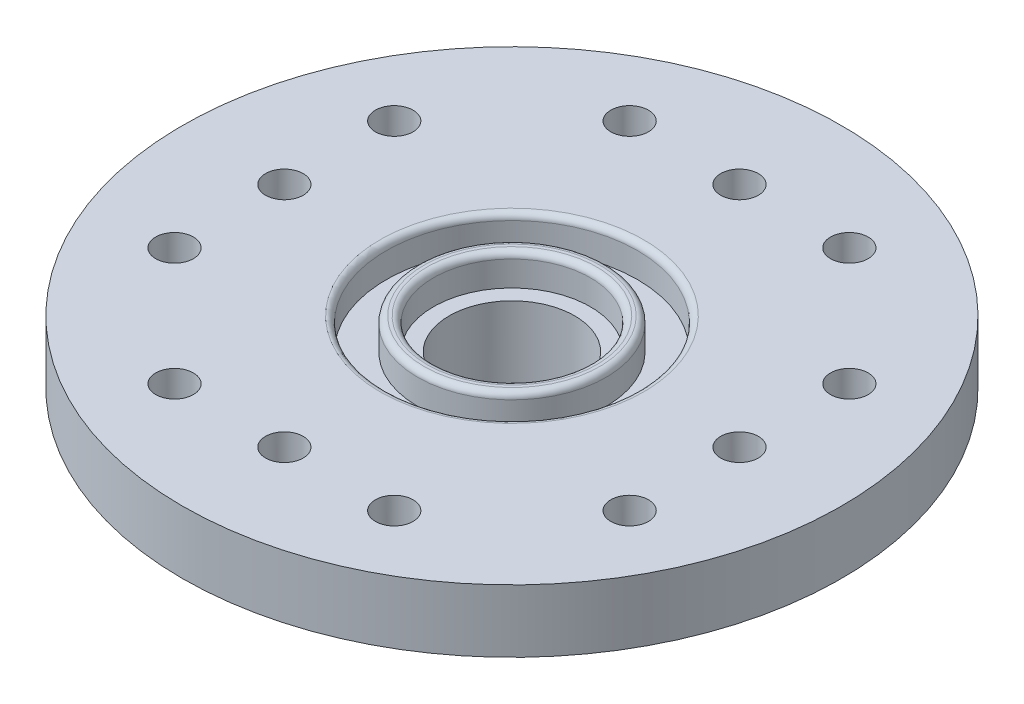
ISO-10303-21;
HEADER;
FILE_DESCRIPTION(('STEP AP214'),'2;1');
FILE_NAME('part.step','',(''),(''),'','','');
FILE_SCHEMA(('AUTOMOTIVE_DESIGN { 1 0 10303 214 1 1 1 1 }'));
ENDSEC;
DATA;
#1=APPLICATION_CONTEXT('core data for automotive mechanical design processes');
#2=APPLICATION_PROTOCOL_DEFINITION('international standard','automotive_design',2000,#1);
#3=PRODUCT_CONTEXT('',#1,'mechanical');
#4=PRODUCT('Part','Part','',(#3));
#5=PRODUCT_RELATED_PRODUCT_CATEGORY('part','',(#4));
#6=PRODUCT_DEFINITION_FORMATION('','',#4);
#7=PRODUCT_DEFINITION_CONTEXT('part definition',#1,'design');
#8=PRODUCT_DEFINITION('design','',#6,#7);
#9=PRODUCT_DEFINITION_SHAPE('','',#8);
#10=(LENGTH_UNIT() NAMED_UNIT(*) SI_UNIT(.MILLI.,.METRE.));
#11=(NAMED_UNIT(*) PLANE_ANGLE_UNIT() SI_UNIT($,.RADIAN.));
#12=(NAMED_UNIT(*) SI_UNIT($,.STERADIAN.) SOLID_ANGLE_UNIT());
#13=UNCERTAINTY_MEASURE_WITH_UNIT(LENGTH_MEASURE(1.E-05),#10,'distance_accuracy_value','');
#14=(GEOMETRIC_REPRESENTATION_CONTEXT(3) GLOBAL_UNCERTAINTY_ASSIGNED_CONTEXT((#13)) GLOBAL_UNIT_ASSIGNED_CONTEXT((#10,
#11,#12)) REPRESENTATION_CONTEXT('',''));
#15=CARTESIAN_POINT('',(0.,0.,0.));
#16=DIRECTION('',(0.,0.,1.));
#17=DIRECTION('',(1.,0.,0.));
#18=AXIS2_PLACEMENT_3D('',#15,#16,#17);
#19=CARTESIAN_POINT('',(0.,-3.,0.));
#20=DIRECTION('',(0.,1.,0.));
#21=DIRECTION('',(0.,0.,1.));
#22=AXIS2_PLACEMENT_3D('',#19,#20,#21);
#23=CYLINDRICAL_SURFACE('',#22,2.);
#24=CARTESIAN_POINT('',(0.,-3.,0.));
#25=DIRECTION('',(0.,-1.,0.));
#26=DIRECTION('',(0.,0.,-1.));
#27=AXIS2_PLACEMENT_3D('',#24,#25,#26);
#28=CIRCLE('',#27,2.);
#29=CARTESIAN_POINT('',(0.,-3.,-2.));
#30=VERTEX_POINT('',#29);
#31=EDGE_CURVE('E124',#30,#30,#28,.T.);
#32=ORIENTED_EDGE('',*,*,#31,.T.);
#33=EDGE_LOOP('',(#32));
#34=FACE_BOUND('',#33,.T.);
#35=CARTESIAN_POINT('',(0.,1.,0.));
#36=DIRECTION('',(0.,1.,0.));
#37=DIRECTION('',(0.,0.,1.));
#38=AXIS2_PLACEMENT_3D('',#35,#36,#37);
#39=CIRCLE('',#38,2.);
#40=CARTESIAN_POINT('',(0.,1.,2.));
#41=VERTEX_POINT('',#40);
#42=EDGE_CURVE('E108',#41,#41,#39,.T.);
#43=ORIENTED_EDGE('',*,*,#42,.T.);
#44=EDGE_LOOP('',(#43));
#45=FACE_BOUND('',#44,.T.);
#46=ADVANCED_FACE('F32',(#34,#45),#23,.F.);
#47=CARTESIAN_POINT('',(0.,2.,0.));
#48=DIRECTION('',(0.,-1.,0.));
#49=DIRECTION('',(0.,0.,-1.));
#50=AXIS2_PLACEMENT_3D('',#47,#48,#49);
#51=CYLINDRICAL_SURFACE('',#50,10.5);
#52=CARTESIAN_POINT('',(0.,2.,0.));
#53=DIRECTION('',(0.,1.,0.));
#54=DIRECTION('',(0.,0.,1.));
#55=AXIS2_PLACEMENT_3D('',#52,#53,#54);
#56=CIRCLE('',#55,10.5);
#57=CARTESIAN_POINT('',(0.,2.,10.5));
#58=VERTEX_POINT('',#57);
#59=EDGE_CURVE('E120',#58,#58,#56,.T.);
#60=ORIENTED_EDGE('',*,*,#59,.F.);
#61=EDGE_LOOP('',(#60));
#62=FACE_BOUND('',#61,.T.);
#63=CARTESIAN_POINT('',(0.,0.,0.));
#64=DIRECTION('',(0.,1.,0.));
#65=DIRECTION('',(0.,0.,1.));
#66=AXIS2_PLACEMENT_3D('',#63,#64,#65);
#67=CIRCLE('',#66,10.5);
#68=CARTESIAN_POINT('',(0.,0.,10.5));
#69=VERTEX_POINT('',#68);
#70=EDGE_CURVE('E121',#69,#69,#67,.T.);
#71=ORIENTED_EDGE('',*,*,#70,.T.);
#72=EDGE_LOOP('',(#71));
#73=FACE_BOUND('',#72,.T.);
#74=ADVANCED_FACE('F168',(#62,#73),#51,.T.);
#75=CARTESIAN_POINT('',(0.,2.,0.));
#76=DIRECTION('',(0.,1.,0.));
#77=DIRECTION('',(0.,0.,1.));
#78=AXIS2_PLACEMENT_3D('',#75,#76,#77);
#79=PLANE('',#78);
#80=CARTESIAN_POINT('',(0.,2.,0.));
#81=DIRECTION('',(0.,1.,0.));
#82=DIRECTION('',(0.,0.,1.));
#83=AXIS2_PLACEMENT_3D('',#80,#81,#82);
#84=CIRCLE('',#83,4.2);
#85=CARTESIAN_POINT('',(0.,2.,4.2));
#86=VERTEX_POINT('',#85);
#87=EDGE_CURVE('E10',#86,#86,#84,.F.);
#88=ORIENTED_EDGE('',*,*,#87,.T.);
#89=EDGE_LOOP('',(#88));
#90=FACE_BOUND('',#89,.T.);
#91=CARTESIAN_POINT('',(7.24999999999994,2.,-3.50000000000008));
#92=DIRECTION('',(0.,1.,0.));
#93=DIRECTION('',(-1.,0.,0.));
#94=AXIS2_PLACEMENT_3D('',#91,#92,#93);
#95=CIRCLE('',#94,0.6);
#96=CARTESIAN_POINT('',(6.64999999999994,2.,-3.50000000000007));
#97=VERTEX_POINT('',#96);
#98=EDGE_CURVE('E63',#97,#97,#95,.T.);
#99=ORIENTED_EDGE('',*,*,#98,.F.);
#100=EDGE_LOOP('',(#99));
#101=FACE_BOUND('',#100,.T.);
#102=CARTESIAN_POINT('',(7.25000000000004,2.,3.49999999999992));
#103=DIRECTION('',(0.,1.,0.));
#104=DIRECTION('',(-1.,0.,0.));
#105=AXIS2_PLACEMENT_3D('',#102,#103,#104);
#106=CIRCLE('',#105,0.6);
#107=CARTESIAN_POINT('',(6.65000000000004,2.,3.49999999999993));
#108=VERTEX_POINT('',#107);
#109=EDGE_CURVE('E62',#108,#108,#106,.T.);
#110=ORIENTED_EDGE('',*,*,#109,.F.);
#111=EDGE_LOOP('',(#110));
#112=FACE_BOUND('',#111,.T.);
#113=CARTESIAN_POINT('',(7.25,2.,0.));
#114=DIRECTION('',(0.,1.,0.));
#115=DIRECTION('',(-1.,0.,0.));
#116=AXIS2_PLACEMENT_3D('',#113,#114,#115);
#117=CIRCLE('',#116,0.6);
#118=CARTESIAN_POINT('',(6.65,2.,0.));
#119=VERTEX_POINT('',#118);
#120=EDGE_CURVE('E67',#119,#119,#117,.T.);
#121=ORIENTED_EDGE('',*,*,#120,.F.);
#122=EDGE_LOOP('',(#121));
#123=FACE_BOUND('',#122,.T.);
#124=CARTESIAN_POINT('',(3.5,2.,7.24999999999998));
#125=DIRECTION('',(0.,1.,0.));
#126=DIRECTION('',(0.,0.,-1.));
#127=AXIS2_PLACEMENT_3D('',#124,#125,#126);
#128=CIRCLE('',#127,0.6);
#129=CARTESIAN_POINT('',(3.5,2.,6.64999999999998));
#130=VERTEX_POINT('',#129);
#131=EDGE_CURVE('E71',#130,#130,#128,.T.);
#132=ORIENTED_EDGE('',*,*,#131,.F.);
#133=EDGE_LOOP('',(#132));
#134=FACE_BOUND('',#133,.T.);
#135=CARTESIAN_POINT('',(-3.5,2.,7.25));
#136=DIRECTION('',(0.,1.,0.));
#137=DIRECTION('',(0.,0.,-1.));
#138=AXIS2_PLACEMENT_3D('',#135,#136,#137);
#139=CIRCLE('',#138,0.6);
#140=CARTESIAN_POINT('',(-3.5,2.,6.65));
#141=VERTEX_POINT('',#140);
#142=EDGE_CURVE('E75',#141,#141,#139,.T.);
#143=ORIENTED_EDGE('',*,*,#142,.F.);
#144=EDGE_LOOP('',(#143));
#145=FACE_BOUND('',#144,.T.);
#146=CARTESIAN_POINT('',(0.,2.,7.25));
#147=DIRECTION('',(0.,1.,0.));
#148=DIRECTION('',(0.,0.,-1.));
#149=AXIS2_PLACEMENT_3D('',#146,#147,#148);
#150=CIRCLE('',#149,0.6);
#151=CARTESIAN_POINT('',(0.,2.,6.65));
#152=VERTEX_POINT('',#151);
#153=EDGE_CURVE('E79',#152,#152,#150,.T.);
#154=ORIENTED_EDGE('',*,*,#153,.F.);
#155=EDGE_LOOP('',(#154));
#156=FACE_BOUND('',#155,.T.);
#157=CARTESIAN_POINT('',(-7.24999999999996,2.,3.50000000000003));
#158=DIRECTION('',(0.,1.,0.));
#159=DIRECTION('',(1.,0.,0.));
#160=AXIS2_PLACEMENT_3D('',#157,#158,#159);
#161=CIRCLE('',#160,0.6);
#162=CARTESIAN_POINT('',(-6.64999999999996,2.,3.50000000000002));
#163=VERTEX_POINT('',#162);
#164=EDGE_CURVE('E83',#163,#163,#161,.T.);
#165=ORIENTED_EDGE('',*,*,#164,.F.);
#166=EDGE_LOOP('',(#165));
#167=FACE_BOUND('',#166,.T.);
#168=CARTESIAN_POINT('',(-7.25000000000001,2.,-3.49999999999998));
#169=DIRECTION('',(0.,1.,0.));
#170=DIRECTION('',(1.,0.,0.));
#171=AXIS2_PLACEMENT_3D('',#168,#169,#170);
#172=CIRCLE('',#171,0.6);
#173=CARTESIAN_POINT('',(-6.65000000000001,2.,-3.49999999999998));
#174=VERTEX_POINT('',#173);
#175=EDGE_CURVE('E87',#174,#174,#172,.T.);
#176=ORIENTED_EDGE('',*,*,#175,.F.);
#177=EDGE_LOOP('',(#176));
#178=FACE_BOUND('',#177,.T.);
#179=CARTESIAN_POINT('',(-7.25,2.,0.));
#180=DIRECTION('',(0.,1.,0.));
#181=DIRECTION('',(1.,0.,0.));
#182=AXIS2_PLACEMENT_3D('',#179,#180,#181);
#183=CIRCLE('',#182,0.6);
#184=CARTESIAN_POINT('',(-6.65,2.,0.));
#185=VERTEX_POINT('',#184);
#186=EDGE_CURVE('E91',#185,#185,#183,.T.);
#187=ORIENTED_EDGE('',*,*,#186,.F.);
#188=EDGE_LOOP('',(#187));
#189=FACE_BOUND('',#188,.T.);
#190=CARTESIAN_POINT('',(-3.5,2.,-7.24999999999998));
#191=DIRECTION('',(0.,1.,0.));
#192=DIRECTION('',(0.,0.,1.));
#193=AXIS2_PLACEMENT_3D('',#190,#191,#192);
#194=CIRCLE('',#193,0.6);
#195=CARTESIAN_POINT('',(-3.5,2.,-6.64999999999998));
#196=VERTEX_POINT('',#195);
#197=EDGE_CURVE('E95',#196,#196,#194,.T.);
#198=ORIENTED_EDGE('',*,*,#197,.F.);
#199=EDGE_LOOP('',(#198));
#200=FACE_BOUND('',#199,.T.);
#201=CARTESIAN_POINT('',(3.5,2.,-7.25));
#202=DIRECTION('',(0.,1.,0.));
#203=DIRECTION('',(0.,0.,1.));
#204=AXIS2_PLACEMENT_3D('',#201,#202,#203);
#205=CIRCLE('',#204,0.6);
#206=CARTESIAN_POINT('',(3.5,2.,-6.65));
#207=VERTEX_POINT('',#206);
#208=EDGE_CURVE('E99',#207,#207,#205,.T.);
#209=ORIENTED_EDGE('',*,*,#208,.F.);
#210=EDGE_LOOP('',(#209));
#211=FACE_BOUND('',#210,.T.);
#212=CARTESIAN_POINT('',(0.,2.,-7.25));
#213=DIRECTION('',(0.,1.,0.));
#214=DIRECTION('',(0.,0.,1.));
#215=AXIS2_PLACEMENT_3D('',#212,#213,#214);
#216=CIRCLE('',#215,0.6);
#217=CARTESIAN_POINT('',(0.,2.,-6.65));
#218=VERTEX_POINT('',#217);
#219=EDGE_CURVE('E103',#218,#218,#216,.T.);
#220=ORIENTED_EDGE('',*,*,#219,.F.);
#221=EDGE_LOOP('',(#220));
#222=FACE_BOUND('',#221,.T.);
#223=ORIENTED_EDGE('',*,*,#59,.T.);
#224=EDGE_LOOP('',(#223));
#225=FACE_BOUND('',#224,.T.);
#226=ADVANCED_FACE('F164',(#90,#101,#112,#123,#134,#145,#156,#167,#178,#189,#200,#211,#222,
#225),#79,.T.);
#227=CARTESIAN_POINT('',(0.,0.,0.));
#228=DIRECTION('',(0.,1.,0.));
#229=DIRECTION('',(0.,0.,1.));
#230=AXIS2_PLACEMENT_3D('',#227,#228,#229);
#231=PLANE('',#230);
#232=CARTESIAN_POINT('',(7.24999999999994,0.,-3.50000000000008));
#233=DIRECTION('',(0.,1.,0.));
#234=DIRECTION('',(0.,0.,1.));
#235=AXIS2_PLACEMENT_3D('',#232,#233,#234);
#236=CIRCLE('',#235,0.6);
#237=CARTESIAN_POINT('',(7.24999999999994,0.,-2.90000000000008));
#238=VERTEX_POINT('',#237);
#239=EDGE_CURVE('E59',#238,#238,#236,.T.);
#240=ORIENTED_EDGE('',*,*,#239,.T.);
#241=EDGE_LOOP('',(#240));
#242=FACE_BOUND('',#241,.T.);
#243=CARTESIAN_POINT('',(7.25000000000004,0.,3.49999999999992));
#244=DIRECTION('',(0.,1.,0.));
#245=DIRECTION('',(0.,0.,1.));
#246=AXIS2_PLACEMENT_3D('',#243,#244,#245);
#247=CIRCLE('',#246,0.6);
#248=CARTESIAN_POINT('',(7.25000000000004,0.,4.09999999999992));
#249=VERTEX_POINT('',#248);
#250=EDGE_CURVE('E64',#249,#249,#247,.T.);
#251=ORIENTED_EDGE('',*,*,#250,.T.);
#252=EDGE_LOOP('',(#251));
#253=FACE_BOUND('',#252,.T.);
#254=CARTESIAN_POINT('',(7.25,0.,0.));
#255=DIRECTION('',(0.,1.,0.));
#256=DIRECTION('',(0.,0.,1.));
#257=AXIS2_PLACEMENT_3D('',#254,#255,#256);
#258=CIRCLE('',#257,0.6);
#259=CARTESIAN_POINT('',(7.25,0.,0.599999999999924));
#260=VERTEX_POINT('',#259);
#261=EDGE_CURVE('E68',#260,#260,#258,.T.);
#262=ORIENTED_EDGE('',*,*,#261,.T.);
#263=EDGE_LOOP('',(#262));
#264=FACE_BOUND('',#263,.T.);
#265=CARTESIAN_POINT('',(3.5,0.,7.24999999999998));
#266=DIRECTION('',(0.,1.,0.));
#267=DIRECTION('',(0.,0.,1.));
#268=AXIS2_PLACEMENT_3D('',#265,#266,#267);
#269=CIRCLE('',#268,0.6);
#270=CARTESIAN_POINT('',(3.5,0.,7.84999999999997));
#271=VERTEX_POINT('',#270);
#272=EDGE_CURVE('E72',#271,#271,#269,.T.);
#273=ORIENTED_EDGE('',*,*,#272,.T.);
#274=EDGE_LOOP('',(#273));
#275=FACE_BOUND('',#274,.T.);
#276=CARTESIAN_POINT('',(-3.5,0.,7.25));
#277=DIRECTION('',(0.,1.,0.));
#278=DIRECTION('',(0.,0.,1.));
#279=AXIS2_PLACEMENT_3D('',#276,#277,#278);
#280=CIRCLE('',#279,0.6);
#281=CARTESIAN_POINT('',(-3.5,0.,7.85));
#282=VERTEX_POINT('',#281);
#283=EDGE_CURVE('E76',#282,#282,#280,.T.);
#284=ORIENTED_EDGE('',*,*,#283,.T.);
#285=EDGE_LOOP('',(#284));
#286=FACE_BOUND('',#285,.T.);
#287=CARTESIAN_POINT('',(0.,0.,7.25));
#288=DIRECTION('',(0.,1.,0.));
#289=DIRECTION('',(0.,0.,1.));
#290=AXIS2_PLACEMENT_3D('',#287,#288,#289);
#291=CIRCLE('',#290,0.6);
#292=CARTESIAN_POINT('',(0.,0.,7.85));
#293=VERTEX_POINT('',#292);
#294=EDGE_CURVE('E80',#293,#293,#291,.T.);
#295=ORIENTED_EDGE('',*,*,#294,.T.);
#296=EDGE_LOOP('',(#295));
#297=FACE_BOUND('',#296,.T.);
#298=CARTESIAN_POINT('',(-7.24999999999996,0.,3.50000000000003));
#299=DIRECTION('',(0.,1.,0.));
#300=DIRECTION('',(0.,0.,1.));
#301=AXIS2_PLACEMENT_3D('',#298,#299,#300);
#302=CIRCLE('',#301,0.6);
#303=CARTESIAN_POINT('',(-7.24999999999996,0.,4.10000000000002));
#304=VERTEX_POINT('',#303);
#305=EDGE_CURVE('E84',#304,#304,#302,.T.);
#306=ORIENTED_EDGE('',*,*,#305,.T.);
#307=EDGE_LOOP('',(#306));
#308=FACE_BOUND('',#307,.T.);
#309=CARTESIAN_POINT('',(-7.25000000000001,0.,-3.49999999999998));
#310=DIRECTION('',(0.,1.,0.));
#311=DIRECTION('',(0.,0.,1.));
#312=AXIS2_PLACEMENT_3D('',#309,#310,#311);
#313=CIRCLE('',#312,0.6);
#314=CARTESIAN_POINT('',(-7.25000000000001,0.,-2.89999999999998));
#315=VERTEX_POINT('',#314);
#316=EDGE_CURVE('E88',#315,#315,#313,.T.);
#317=ORIENTED_EDGE('',*,*,#316,.T.);
#318=EDGE_LOOP('',(#317));
#319=FACE_BOUND('',#318,.T.);
#320=CARTESIAN_POINT('',(-7.25,0.,0.));
#321=DIRECTION('',(0.,1.,0.));
#322=DIRECTION('',(0.,0.,1.));
#323=AXIS2_PLACEMENT_3D('',#320,#321,#322);
#324=CIRCLE('',#323,0.6);
#325=CARTESIAN_POINT('',(-7.25,0.,0.600000000000025));
#326=VERTEX_POINT('',#325);
#327=EDGE_CURVE('E92',#326,#326,#324,.T.);
#328=ORIENTED_EDGE('',*,*,#327,.T.);
#329=EDGE_LOOP('',(#328));
#330=FACE_BOUND('',#329,.T.);
#331=CARTESIAN_POINT('',(-3.5,0.,-7.24999999999998));
#332=DIRECTION('',(0.,1.,0.));
#333=DIRECTION('',(0.,0.,1.));
#334=AXIS2_PLACEMENT_3D('',#331,#332,#333);
#335=CIRCLE('',#334,0.6);
#336=CARTESIAN_POINT('',(-3.5,0.,-6.64999999999998));
#337=VERTEX_POINT('',#336);
#338=EDGE_CURVE('E96',#337,#337,#335,.T.);
#339=ORIENTED_EDGE('',*,*,#338,.T.);
#340=EDGE_LOOP('',(#339));
#341=FACE_BOUND('',#340,.T.);
#342=CARTESIAN_POINT('',(3.5,0.,-7.25));
#343=DIRECTION('',(0.,1.,0.));
#344=DIRECTION('',(0.,0.,1.));
#345=AXIS2_PLACEMENT_3D('',#342,#343,#344);
#346=CIRCLE('',#345,0.6);
#347=CARTESIAN_POINT('',(3.5,0.,-6.65));
#348=VERTEX_POINT('',#347);
#349=EDGE_CURVE('E100',#348,#348,#346,.T.);
#350=ORIENTED_EDGE('',*,*,#349,.T.);
#351=EDGE_LOOP('',(#350));
#352=FACE_BOUND('',#351,.T.);
#353=CARTESIAN_POINT('',(0.,0.,-7.25));
#354=DIRECTION('',(0.,1.,0.));
#355=DIRECTION('',(0.,0.,1.));
#356=AXIS2_PLACEMENT_3D('',#353,#354,#355);
#357=CIRCLE('',#356,0.6);
#358=CARTESIAN_POINT('',(0.,0.,-6.65));
#359=VERTEX_POINT('',#358);
#360=EDGE_CURVE('E104',#359,#359,#357,.T.);
#361=ORIENTED_EDGE('',*,*,#360,.T.);
#362=EDGE_LOOP('',(#361));
#363=FACE_BOUND('',#362,.T.);
#364=CARTESIAN_POINT('',(0.,0.,0.));
#365=DIRECTION('',(0.,1.,0.));
#366=DIRECTION('',(0.,0.,1.));
#367=AXIS2_PLACEMENT_3D('',#364,#365,#366);
#368=CIRCLE('',#367,4.);
#369=CARTESIAN_POINT('',(0.,0.,4.));
#370=VERTEX_POINT('',#369);
#371=EDGE_CURVE('E117',#370,#370,#368,.F.);
#372=ORIENTED_EDGE('',*,*,#371,.F.);
#373=EDGE_LOOP('',(#372));
#374=FACE_BOUND('',#373,.T.);
#375=ORIENTED_EDGE('',*,*,#70,.F.);
#376=EDGE_LOOP('',(#375));
#377=FACE_BOUND('',#376,.T.);
#378=ADVANCED_FACE('F167',(#242,#253,#264,#275,#286,#297,#308,#319,#330,#341,#352,#363,#374,
#377),#231,.F.);
#379=CARTESIAN_POINT('',(0.,-3.,0.));
#380=DIRECTION('',(0.,-1.,0.));
#381=DIRECTION('',(0.,0.,-1.));
#382=AXIS2_PLACEMENT_3D('',#379,#380,#381);
#383=PLANE('',#382);
#384=CARTESIAN_POINT('',(0.,-3.,0.));
#385=DIRECTION('',(0.,-1.,0.));
#386=DIRECTION('',(0.,0.,-1.));
#387=AXIS2_PLACEMENT_3D('',#384,#385,#386);
#388=CIRCLE('',#387,3.);
#389=CARTESIAN_POINT('',(0.,-3.,-3.));
#390=VERTEX_POINT('',#389);
#391=EDGE_CURVE('E114',#390,#390,#388,.T.);
#392=ORIENTED_EDGE('',*,*,#391,.T.);
#393=EDGE_LOOP('',(#392));
#394=FACE_BOUND('',#393,.T.);
#395=ORIENTED_EDGE('',*,*,#31,.F.);
#396=EDGE_LOOP('',(#395));
#397=FACE_BOUND('',#396,.T.);
#398=ADVANCED_FACE('F201',(#394,#397),#383,.T.);
#399=CARTESIAN_POINT('',(0.,-3.,0.));
#400=DIRECTION('',(0.,1.,0.));
#401=DIRECTION('',(0.,0.,1.));
#402=AXIS2_PLACEMENT_3D('',#399,#400,#401);
#403=CYLINDRICAL_SURFACE('',#402,4.);
#404=CARTESIAN_POINT('',(0.,-2.,0.));
#405=DIRECTION('',(0.,-1.,0.));
#406=DIRECTION('',(0.,0.,-1.));
#407=AXIS2_PLACEMENT_3D('',#404,#405,#406);
#408=CIRCLE('',#407,4.);
#409=CARTESIAN_POINT('',(0.,-2.,-4.));
#410=VERTEX_POINT('',#409);
#411=EDGE_CURVE('E58',#410,#410,#408,.F.);
#412=ORIENTED_EDGE('',*,*,#411,.T.);
#413=EDGE_LOOP('',(#412));
#414=FACE_BOUND('',#413,.T.);
#415=ORIENTED_EDGE('',*,*,#371,.T.);
#416=EDGE_LOOP('',(#415));
#417=FACE_BOUND('',#416,.T.);
#418=ADVANCED_FACE('F207',(#414,#417),#403,.T.);
#419=CARTESIAN_POINT('',(0.,-2.,0.));
#420=DIRECTION('',(0.,-1.,0.));
#421=DIRECTION('',(0.,0.,-1.));
#422=AXIS2_PLACEMENT_3D('',#419,#420,#421);
#423=TOROIDAL_SURFACE('',#422,3.,1.);
#424=ORIENTED_EDGE('',*,*,#411,.F.);
#425=EDGE_LOOP('',(#424));
#426=FACE_BOUND('',#425,.T.);
#427=ORIENTED_EDGE('',*,*,#391,.F.);
#428=EDGE_LOOP('',(#427));
#429=FACE_BOUND('',#428,.T.);
#430=ADVANCED_FACE('F222',(#426,#429),#423,.T.);
#431=CARTESIAN_POINT('',(0.,1.,0.));
#432=DIRECTION('',(0.,1.,0.));
#433=DIRECTION('',(0.,0.,1.));
#434=AXIS2_PLACEMENT_3D('',#431,#432,#433);
#435=CYLINDRICAL_SURFACE('',#434,4.);
#436=CARTESIAN_POINT('',(0.,1.8,0.));
#437=DIRECTION('',(0.,1.,0.));
#438=DIRECTION('',(0.,0.,1.));
#439=AXIS2_PLACEMENT_3D('',#436,#437,#438);
#440=CIRCLE('',#439,4.);
#441=CARTESIAN_POINT('',(0.,1.8,4.));
#442=VERTEX_POINT('',#441);
#443=EDGE_CURVE('E39',#442,#442,#440,.T.);
#444=ORIENTED_EDGE('',*,*,#443,.T.);
#445=EDGE_LOOP('',(#444));
#446=FACE_BOUND('',#445,.T.);
#447=CARTESIAN_POINT('',(0.,1.,0.));
#448=DIRECTION('',(0.,1.,0.));
#449=DIRECTION('',(0.,0.,1.));
#450=AXIS2_PLACEMENT_3D('',#447,#448,#449);
#451=CIRCLE('',#450,4.);
#452=CARTESIAN_POINT('',(0.,1.,4.));
#453=VERTEX_POINT('',#452);
#454=EDGE_CURVE('E129',#453,#453,#451,.T.);
#455=ORIENTED_EDGE('',*,*,#454,.F.);
#456=EDGE_LOOP('',(#455));
#457=FACE_BOUND('',#456,.T.);
#458=ADVANCED_FACE('F218',(#446,#457),#435,.F.);
#459=CARTESIAN_POINT('',(0.,1.,0.));
#460=DIRECTION('',(0.,1.,0.));
#461=DIRECTION('',(0.,0.,1.));
#462=AXIS2_PLACEMENT_3D('',#459,#460,#461);
#463=PLANE('',#462);
#464=CARTESIAN_POINT('',(0.,1.,0.));
#465=DIRECTION('',(0.,1.,0.));
#466=DIRECTION('',(0.,0.,1.));
#467=AXIS2_PLACEMENT_3D('',#464,#465,#466);
#468=CIRCLE('',#467,3.);
#469=CARTESIAN_POINT('',(0.,1.,3.));
#470=VERTEX_POINT('',#469);
#471=EDGE_CURVE('E111',#470,#470,#468,.T.);
#472=ORIENTED_EDGE('',*,*,#471,.F.);
#473=EDGE_LOOP('',(#472));
#474=FACE_BOUND('',#473,.T.);
#475=ORIENTED_EDGE('',*,*,#454,.T.);
#476=EDGE_LOOP('',(#475));
#477=FACE_BOUND('',#476,.T.);
#478=ADVANCED_FACE('F240',(#474,#477),#463,.T.);
#479=CARTESIAN_POINT('',(0.,1.,0.));
#480=DIRECTION('',(0.,1.,0.));
#481=DIRECTION('',(0.,0.,1.));
#482=AXIS2_PLACEMENT_3D('',#479,#480,#481);
#483=CYLINDRICAL_SURFACE('',#482,3.);
#484=CARTESIAN_POINT('',(0.,1.8,0.));
#485=DIRECTION('',(0.,1.,0.));
#486=DIRECTION('',(0.,0.,1.));
#487=AXIS2_PLACEMENT_3D('',#484,#485,#486);
#488=CIRCLE('',#487,3.);
#489=CARTESIAN_POINT('',(0.,1.8,3.));
#490=VERTEX_POINT('',#489);
#491=EDGE_CURVE('E43',#490,#490,#488,.F.);
#492=ORIENTED_EDGE('',*,*,#491,.T.);
#493=EDGE_LOOP('',(#492));
#494=FACE_BOUND('',#493,.T.);
#495=ORIENTED_EDGE('',*,*,#471,.T.);
#496=EDGE_LOOP('',(#495));
#497=FACE_BOUND('',#496,.T.);
#498=ADVANCED_FACE('F258',(#494,#497),#483,.T.);
#499=CARTESIAN_POINT('',(0.,2.,0.));
#500=DIRECTION('',(0.,1.,0.));
#501=DIRECTION('',(0.,0.,1.));
#502=AXIS2_PLACEMENT_3D('',#499,#500,#501);
#503=CIRCLE('',#502,2.7);
#504=CARTESIAN_POINT('',(0.,2.,2.7));
#505=VERTEX_POINT('',#504);
#506=EDGE_CURVE('E47',#505,#505,#503,.F.);
#507=ORIENTED_EDGE('',*,*,#506,.T.);
#508=EDGE_LOOP('',(#507));
#509=FACE_BOUND('',#508,.T.);
#510=CARTESIAN_POINT('',(0.,2.,0.));
#511=DIRECTION('',(0.,1.,0.));
#512=DIRECTION('',(0.,0.,1.));
#513=AXIS2_PLACEMENT_3D('',#510,#511,#512);
#514=CIRCLE('',#513,2.8);
#515=CARTESIAN_POINT('',(0.,2.,2.8));
#516=VERTEX_POINT('',#515);
#517=EDGE_CURVE('E52',#516,#516,#514,.T.);
#518=ORIENTED_EDGE('',*,*,#517,.T.);
#519=EDGE_LOOP('',(#518));
#520=FACE_BOUND('',#519,.T.);
#521=ADVANCED_FACE('F170',(#509,#520),#79,.T.);
#522=CARTESIAN_POINT('',(0.,1.,0.));
#523=DIRECTION('',(0.,1.,0.));
#524=DIRECTION('',(0.,0.,1.));
#525=AXIS2_PLACEMENT_3D('',#522,#523,#524);
#526=CYLINDRICAL_SURFACE('',#525,2.5);
#527=CARTESIAN_POINT('',(0.,1.8,0.));
#528=DIRECTION('',(0.,1.,0.));
#529=DIRECTION('',(0.,0.,1.));
#530=AXIS2_PLACEMENT_3D('',#527,#528,#529);
#531=CIRCLE('',#530,2.5);
#532=CARTESIAN_POINT('',(0.,1.8,2.5));
#533=VERTEX_POINT('',#532);
#534=EDGE_CURVE('E55',#533,#533,#531,.T.);
#535=ORIENTED_EDGE('',*,*,#534,.T.);
#536=EDGE_LOOP('',(#535));
#537=FACE_BOUND('',#536,.T.);
#538=CARTESIAN_POINT('',(0.,1.,0.));
#539=DIRECTION('',(0.,1.,0.));
#540=DIRECTION('',(0.,0.,1.));
#541=AXIS2_PLACEMENT_3D('',#538,#539,#540);
#542=CIRCLE('',#541,2.5);
#543=CARTESIAN_POINT('',(0.,1.,2.5));
#544=VERTEX_POINT('',#543);
#545=EDGE_CURVE('E107',#544,#544,#542,.T.);
#546=ORIENTED_EDGE('',*,*,#545,.F.);
#547=EDGE_LOOP('',(#546));
#548=FACE_BOUND('',#547,.T.);
#549=ADVANCED_FACE('F257',(#537,#548),#526,.F.);
#550=CARTESIAN_POINT('',(0.,1.,0.));
#551=DIRECTION('',(0.,1.,0.));
#552=DIRECTION('',(0.,0.,1.));
#553=AXIS2_PLACEMENT_3D('',#550,#551,#552);
#554=PLANE('',#553);
#555=ORIENTED_EDGE('',*,*,#42,.F.);
#556=EDGE_LOOP('',(#555));
#557=FACE_BOUND('',#556,.T.);
#558=ORIENTED_EDGE('',*,*,#545,.T.);
#559=EDGE_LOOP('',(#558));
#560=FACE_BOUND('',#559,.T.);
#561=ADVANCED_FACE('F264',(#557,#560),#554,.T.);
#562=CARTESIAN_POINT('',(0.,-3.,-7.25));
#563=DIRECTION('',(0.,1.,0.));
#564=DIRECTION('',(0.,0.,1.));
#565=AXIS2_PLACEMENT_3D('',#562,#563,#564);
#566=CYLINDRICAL_SURFACE('',#565,0.6);
#567=ORIENTED_EDGE('',*,*,#219,.T.);
#568=EDGE_LOOP('',(#567));
#569=FACE_BOUND('',#568,.T.);
#570=ORIENTED_EDGE('',*,*,#360,.F.);
#571=EDGE_LOOP('',(#570));
#572=FACE_BOUND('',#571,.T.);
#573=ADVANCED_FACE('F276',(#569,#572),#566,.F.);
#574=CARTESIAN_POINT('',(3.5,-3.,-7.25));
#575=DIRECTION('',(0.,1.,0.));
#576=DIRECTION('',(0.,0.,1.));
#577=AXIS2_PLACEMENT_3D('',#574,#575,#576);
#578=CYLINDRICAL_SURFACE('',#577,0.6);
#579=ORIENTED_EDGE('',*,*,#208,.T.);
#580=EDGE_LOOP('',(#579));
#581=FACE_BOUND('',#580,.T.);
#582=ORIENTED_EDGE('',*,*,#349,.F.);
#583=EDGE_LOOP('',(#582));
#584=FACE_BOUND('',#583,.T.);
#585=ADVANCED_FACE('F282',(#581,#584),#578,.F.);
#586=CARTESIAN_POINT('',(-3.5,-3.,-7.24999999999998));
#587=DIRECTION('',(0.,1.,0.));
#588=DIRECTION('',(0.,0.,1.));
#589=AXIS2_PLACEMENT_3D('',#586,#587,#588);
#590=CYLINDRICAL_SURFACE('',#589,0.6);
#591=ORIENTED_EDGE('',*,*,#197,.T.);
#592=EDGE_LOOP('',(#591));
#593=FACE_BOUND('',#592,.T.);
#594=ORIENTED_EDGE('',*,*,#338,.F.);
#595=EDGE_LOOP('',(#594));
#596=FACE_BOUND('',#595,.T.);
#597=ADVANCED_FACE('F406',(#593,#596),#590,.F.);
#598=CARTESIAN_POINT('',(-7.25,-3.,0.));
#599=DIRECTION('',(0.,1.,0.));
#600=DIRECTION('',(0.,0.,1.));
#601=AXIS2_PLACEMENT_3D('',#598,#599,#600);
#602=CYLINDRICAL_SURFACE('',#601,0.6);
#603=ORIENTED_EDGE('',*,*,#186,.T.);
#604=EDGE_LOOP('',(#603));
#605=FACE_BOUND('',#604,.T.);
#606=ORIENTED_EDGE('',*,*,#327,.F.);
#607=EDGE_LOOP('',(#606));
#608=FACE_BOUND('',#607,.T.);
#609=ADVANCED_FACE('F398',(#605,#608),#602,.F.);
#610=CARTESIAN_POINT('',(-7.25000000000001,-3.,-3.49999999999998));
#611=DIRECTION('',(0.,1.,0.));
#612=DIRECTION('',(0.,0.,1.));
#613=AXIS2_PLACEMENT_3D('',#610,#611,#612);
#614=CYLINDRICAL_SURFACE('',#613,0.6);
#615=ORIENTED_EDGE('',*,*,#175,.T.);
#616=EDGE_LOOP('',(#615));
#617=FACE_BOUND('',#616,.T.);
#618=ORIENTED_EDGE('',*,*,#316,.F.);
#619=EDGE_LOOP('',(#618));
#620=FACE_BOUND('',#619,.T.);
#621=ADVANCED_FACE('F390',(#617,#620),#614,.F.);
#622=CARTESIAN_POINT('',(-7.24999999999996,-3.,3.50000000000003));
#623=DIRECTION('',(0.,1.,0.));
#624=DIRECTION('',(0.,0.,1.));
#625=AXIS2_PLACEMENT_3D('',#622,#623,#624);
#626=CYLINDRICAL_SURFACE('',#625,0.6);
#627=ORIENTED_EDGE('',*,*,#164,.T.);
#628=EDGE_LOOP('',(#627));
#629=FACE_BOUND('',#628,.T.);
#630=ORIENTED_EDGE('',*,*,#305,.F.);
#631=EDGE_LOOP('',(#630));
#632=FACE_BOUND('',#631,.T.);
#633=ADVANCED_FACE('F382',(#629,#632),#626,.F.);
#634=CARTESIAN_POINT('',(0.,-3.,7.25));
#635=DIRECTION('',(0.,1.,0.));
#636=DIRECTION('',(0.,0.,1.));
#637=AXIS2_PLACEMENT_3D('',#634,#635,#636);
#638=CYLINDRICAL_SURFACE('',#637,0.6);
#639=ORIENTED_EDGE('',*,*,#153,.T.);
#640=EDGE_LOOP('',(#639));
#641=FACE_BOUND('',#640,.T.);
#642=ORIENTED_EDGE('',*,*,#294,.F.);
#643=EDGE_LOOP('',(#642));
#644=FACE_BOUND('',#643,.T.);
#645=ADVANCED_FACE('F374',(#641,#644),#638,.F.);
#646=CARTESIAN_POINT('',(-3.5,-3.,7.25));
#647=DIRECTION('',(0.,1.,0.));
#648=DIRECTION('',(0.,0.,1.));
#649=AXIS2_PLACEMENT_3D('',#646,#647,#648);
#650=CYLINDRICAL_SURFACE('',#649,0.6);
#651=ORIENTED_EDGE('',*,*,#142,.T.);
#652=EDGE_LOOP('',(#651));
#653=FACE_BOUND('',#652,.T.);
#654=ORIENTED_EDGE('',*,*,#283,.F.);
#655=EDGE_LOOP('',(#654));
#656=FACE_BOUND('',#655,.T.);
#657=ADVANCED_FACE('F366',(#653,#656),#650,.F.);
#658=CARTESIAN_POINT('',(3.5,-3.,7.24999999999998));
#659=DIRECTION('',(0.,1.,0.));
#660=DIRECTION('',(0.,0.,1.));
#661=AXIS2_PLACEMENT_3D('',#658,#659,#660);
#662=CYLINDRICAL_SURFACE('',#661,0.6);
#663=ORIENTED_EDGE('',*,*,#131,.T.);
#664=EDGE_LOOP('',(#663));
#665=FACE_BOUND('',#664,.T.);
#666=ORIENTED_EDGE('',*,*,#272,.F.);
#667=EDGE_LOOP('',(#666));
#668=FACE_BOUND('',#667,.T.);
#669=ADVANCED_FACE('F358',(#665,#668),#662,.F.);
#670=CARTESIAN_POINT('',(7.25,-3.,0.));
#671=DIRECTION('',(0.,1.,0.));
#672=DIRECTION('',(0.,0.,1.));
#673=AXIS2_PLACEMENT_3D('',#670,#671,#672);
#674=CYLINDRICAL_SURFACE('',#673,0.6);
#675=ORIENTED_EDGE('',*,*,#120,.T.);
#676=EDGE_LOOP('',(#675));
#677=FACE_BOUND('',#676,.T.);
#678=ORIENTED_EDGE('',*,*,#261,.F.);
#679=EDGE_LOOP('',(#678));
#680=FACE_BOUND('',#679,.T.);
#681=ADVANCED_FACE('F350',(#677,#680),#674,.F.);
#682=CARTESIAN_POINT('',(7.25000000000004,-3.,3.49999999999992));
#683=DIRECTION('',(0.,1.,0.));
#684=DIRECTION('',(0.,0.,1.));
#685=AXIS2_PLACEMENT_3D('',#682,#683,#684);
#686=CYLINDRICAL_SURFACE('',#685,0.6);
#687=ORIENTED_EDGE('',*,*,#109,.T.);
#688=EDGE_LOOP('',(#687));
#689=FACE_BOUND('',#688,.T.);
#690=ORIENTED_EDGE('',*,*,#250,.F.);
#691=EDGE_LOOP('',(#690));
#692=FACE_BOUND('',#691,.T.);
#693=ADVANCED_FACE('F344',(#689,#692),#686,.F.);
#694=CARTESIAN_POINT('',(7.24999999999994,-3.,-3.50000000000008));
#695=DIRECTION('',(0.,1.,0.));
#696=DIRECTION('',(0.,0.,1.));
#697=AXIS2_PLACEMENT_3D('',#694,#695,#696);
#698=CYLINDRICAL_SURFACE('',#697,0.6);
#699=ORIENTED_EDGE('',*,*,#98,.T.);
#700=EDGE_LOOP('',(#699));
#701=FACE_BOUND('',#700,.T.);
#702=ORIENTED_EDGE('',*,*,#239,.F.);
#703=EDGE_LOOP('',(#702));
#704=FACE_BOUND('',#703,.T.);
#705=ADVANCED_FACE('F161',(#701,#704),#698,.F.);
#706=CARTESIAN_POINT('',(0.,1.8,0.));
#707=DIRECTION('',(0.,1.,0.));
#708=DIRECTION('',(0.,0.,1.));
#709=AXIS2_PLACEMENT_3D('',#706,#707,#708);
#710=TOROIDAL_SURFACE('',#709,2.7,0.2);
#711=ORIENTED_EDGE('',*,*,#506,.F.);
#712=EDGE_LOOP('',(#711));
#713=FACE_BOUND('',#712,.T.);
#714=ORIENTED_EDGE('',*,*,#534,.F.);
#715=EDGE_LOOP('',(#714));
#716=FACE_BOUND('',#715,.T.);
#717=ADVANCED_FACE('F242',(#713,#716),#710,.T.);
#718=CARTESIAN_POINT('',(0.,1.8,0.));
#719=DIRECTION('',(0.,1.,0.));
#720=DIRECTION('',(0.,0.,1.));
#721=AXIS2_PLACEMENT_3D('',#718,#719,#720);
#722=TOROIDAL_SURFACE('',#721,2.8,0.2);
#723=ORIENTED_EDGE('',*,*,#491,.F.);
#724=EDGE_LOOP('',(#723));
#725=FACE_BOUND('',#724,.T.);
#726=ORIENTED_EDGE('',*,*,#517,.F.);
#727=EDGE_LOOP('',(#726));
#728=FACE_BOUND('',#727,.T.);
#729=ADVANCED_FACE('F244',(#725,#728),#722,.T.);
#730=CARTESIAN_POINT('',(0.,1.8,0.));
#731=DIRECTION('',(0.,1.,0.));
#732=DIRECTION('',(0.,0.,1.));
#733=AXIS2_PLACEMENT_3D('',#730,#731,#732);
#734=TOROIDAL_SURFACE('',#733,4.2,0.2);
#735=ORIENTED_EDGE('',*,*,#87,.F.);
#736=EDGE_LOOP('',(#735));
#737=FACE_BOUND('',#736,.T.);
#738=ORIENTED_EDGE('',*,*,#443,.F.);
#739=EDGE_LOOP('',(#738));
#740=FACE_BOUND('',#739,.T.);
#741=ADVANCED_FACE('F34',(#737,#740),#734,.T.);
#742=CLOSED_SHELL('',(#46,#74,#226,#378,#398,#418,#430,#458,#478,#498,#521,#549,#561,#573,#585,
#597,#609,#621,#633,#645,#657,#669,#681,#693,#705,#717,#729,#741));
#743=MANIFOLD_SOLID_BREP('B2',#742);
#744=ADVANCED_BREP_SHAPE_REPRESENTATION('',(#18,#743),#14);
#745=SHAPE_DEFINITION_REPRESENTATION(#9,#744);
ENDSEC;
END-ISO-10303-21;
